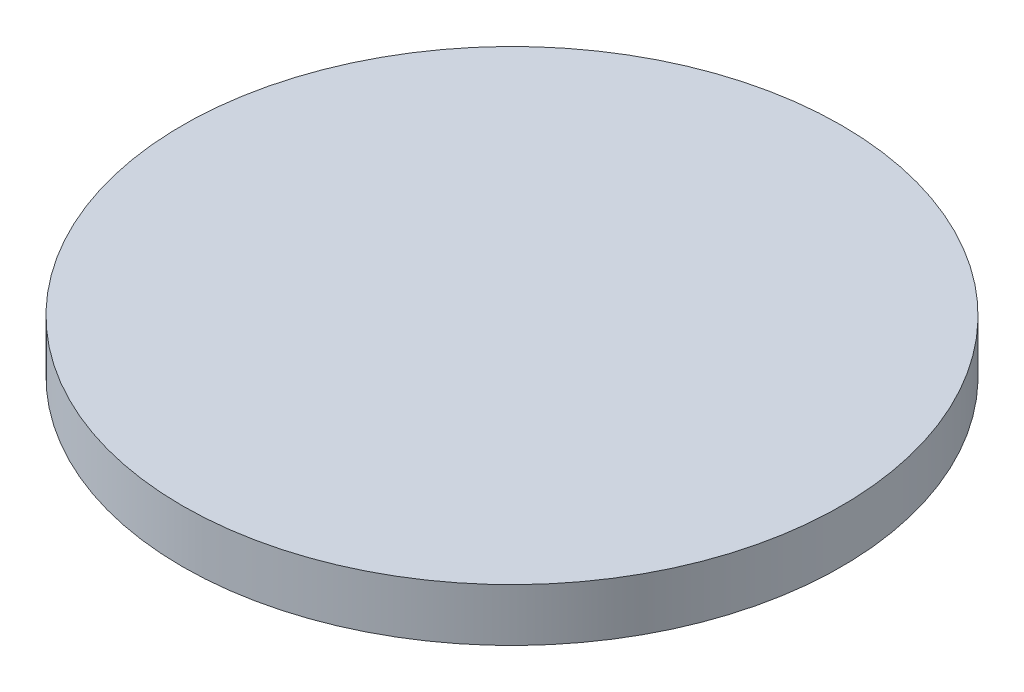
ISO-10303-21;
HEADER;
FILE_DESCRIPTION(('STEP AP214'),'2;1');
FILE_NAME('part.step','',(''),(''),'','','');
FILE_SCHEMA(('AUTOMOTIVE_DESIGN { 1 0 10303 214 1 1 1 1 }'));
ENDSEC;
DATA;
#1=APPLICATION_CONTEXT('core data for automotive mechanical design processes');
#2=APPLICATION_PROTOCOL_DEFINITION('international standard','automotive_design',2000,#1);
#3=PRODUCT_CONTEXT('',#1,'mechanical');
#4=PRODUCT('Part','Part','',(#3));
#5=PRODUCT_RELATED_PRODUCT_CATEGORY('part','',(#4));
#6=PRODUCT_DEFINITION_FORMATION('','',#4);
#7=PRODUCT_DEFINITION_CONTEXT('part definition',#1,'design');
#8=PRODUCT_DEFINITION('design','',#6,#7);
#9=PRODUCT_DEFINITION_SHAPE('','',#8);
#10=(LENGTH_UNIT() NAMED_UNIT(*) SI_UNIT(.MILLI.,.METRE.));
#11=(NAMED_UNIT(*) PLANE_ANGLE_UNIT() SI_UNIT($,.RADIAN.));
#12=(NAMED_UNIT(*) SI_UNIT($,.STERADIAN.) SOLID_ANGLE_UNIT());
#13=UNCERTAINTY_MEASURE_WITH_UNIT(LENGTH_MEASURE(1.E-05),#10,'distance_accuracy_value','');
#14=(GEOMETRIC_REPRESENTATION_CONTEXT(3) GLOBAL_UNCERTAINTY_ASSIGNED_CONTEXT((#13)) GLOBAL_UNIT_ASSIGNED_CONTEXT((#10,
#11,#12)) REPRESENTATION_CONTEXT('',''));
#15=CARTESIAN_POINT('',(0.,0.,0.));
#16=DIRECTION('',(0.,0.,1.));
#17=DIRECTION('',(1.,0.,0.));
#18=AXIS2_PLACEMENT_3D('',#15,#16,#17);
#19=CARTESIAN_POINT('',(0.,3.175,0.));
#20=DIRECTION('',(0.,-1.,0.));
#21=DIRECTION('',(0.,0.,-1.));
#22=AXIS2_PLACEMENT_3D('',#19,#20,#21);
#23=CYLINDRICAL_SURFACE('',#22,19.84375);
#24=CARTESIAN_POINT('',(0.,3.175,0.));
#25=DIRECTION('',(0.,1.,0.));
#26=DIRECTION('',(0.,0.,1.));
#27=AXIS2_PLACEMENT_3D('',#24,#25,#26);
#28=CIRCLE('',#27,19.84375);
#29=CARTESIAN_POINT('',(0.,3.175,19.84375));
#30=VERTEX_POINT('',#29);
#31=EDGE_CURVE('E10',#30,#30,#28,.T.);
#32=ORIENTED_EDGE('',*,*,#31,.F.);
#33=EDGE_LOOP('',(#32));
#34=FACE_BOUND('',#33,.T.);
#35=CARTESIAN_POINT('',(0.,0.,0.));
#36=DIRECTION('',(0.,1.,0.));
#37=DIRECTION('',(0.,0.,1.));
#38=AXIS2_PLACEMENT_3D('',#35,#36,#37);
#39=CIRCLE('',#38,19.84375);
#40=CARTESIAN_POINT('',(0.,0.,19.84375));
#41=VERTEX_POINT('',#40);
#42=EDGE_CURVE('E38',#41,#41,#39,.T.);
#43=ORIENTED_EDGE('',*,*,#42,.T.);
#44=EDGE_LOOP('',(#43));
#45=FACE_BOUND('',#44,.T.);
#46=ADVANCED_FACE('F35',(#34,#45),#23,.T.);
#47=CARTESIAN_POINT('',(0.,3.175,0.));
#48=DIRECTION('',(0.,1.,0.));
#49=DIRECTION('',(0.,0.,1.));
#50=AXIS2_PLACEMENT_3D('',#47,#48,#49);
#51=PLANE('',#50);
#52=ORIENTED_EDGE('',*,*,#31,.T.);
#53=EDGE_LOOP('',(#52));
#54=FACE_BOUND('',#53,.T.);
#55=ADVANCED_FACE('F50',(#54),#51,.T.);
#56=CARTESIAN_POINT('',(0.,0.,0.));
#57=DIRECTION('',(0.,1.,0.));
#58=DIRECTION('',(0.,0.,1.));
#59=AXIS2_PLACEMENT_3D('',#56,#57,#58);
#60=PLANE('',#59);
#61=ORIENTED_EDGE('',*,*,#42,.F.);
#62=EDGE_LOOP('',(#61));
#63=FACE_BOUND('',#62,.T.);
#64=ADVANCED_FACE('F48',(#63),#60,.F.);
#65=CLOSED_SHELL('',(#46,#55,#64));
#66=MANIFOLD_SOLID_BREP('B2',#65);
#67=ADVANCED_BREP_SHAPE_REPRESENTATION('',(#18,#66),#14);
#68=SHAPE_DEFINITION_REPRESENTATION(#9,#67);
ENDSEC;
END-ISO-10303-21;
